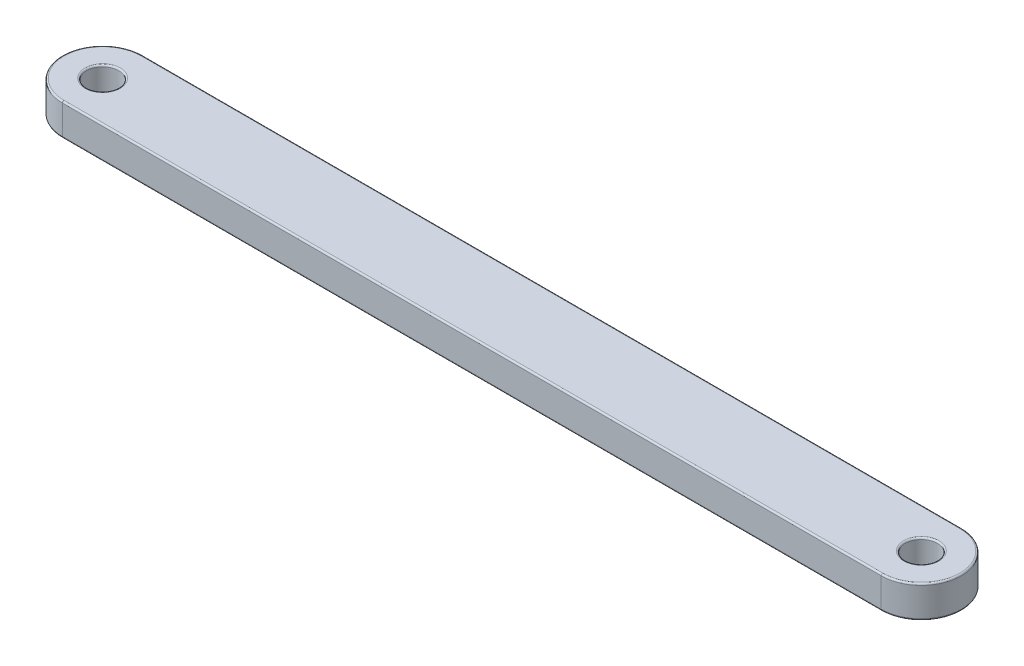
ISO-10303-21;
HEADER;
FILE_DESCRIPTION(('STEP AP214'),'2;1');
FILE_NAME('part.step','',(''),(''),'','','');
FILE_SCHEMA(('AUTOMOTIVE_DESIGN { 1 0 10303 214 1 1 1 1 }'));
ENDSEC;
DATA;
#1=APPLICATION_CONTEXT('core data for automotive mechanical design processes');
#2=APPLICATION_PROTOCOL_DEFINITION('international standard','automotive_design',2000,#1);
#3=PRODUCT_CONTEXT('',#1,'mechanical');
#4=PRODUCT('Part','Part','',(#3));
#5=PRODUCT_RELATED_PRODUCT_CATEGORY('part','',(#4));
#6=PRODUCT_DEFINITION_FORMATION('','',#4);
#7=PRODUCT_DEFINITION_CONTEXT('part definition',#1,'design');
#8=PRODUCT_DEFINITION('design','',#6,#7);
#9=PRODUCT_DEFINITION_SHAPE('','',#8);
#10=(LENGTH_UNIT() NAMED_UNIT(*) SI_UNIT(.MILLI.,.METRE.));
#11=(NAMED_UNIT(*) PLANE_ANGLE_UNIT() SI_UNIT($,.RADIAN.));
#12=(NAMED_UNIT(*) SI_UNIT($,.STERADIAN.) SOLID_ANGLE_UNIT());
#13=UNCERTAINTY_MEASURE_WITH_UNIT(LENGTH_MEASURE(1.E-05),#10,'distance_accuracy_value','');
#14=(GEOMETRIC_REPRESENTATION_CONTEXT(3) GLOBAL_UNCERTAINTY_ASSIGNED_CONTEXT((#13)) GLOBAL_UNIT_ASSIGNED_CONTEXT((#10,
#11,#12)) REPRESENTATION_CONTEXT('',''));
#15=CARTESIAN_POINT('',(0.,0.,0.));
#16=DIRECTION('',(0.,0.,1.));
#17=DIRECTION('',(1.,0.,0.));
#18=AXIS2_PLACEMENT_3D('',#15,#16,#17);
#19=CARTESIAN_POINT('',(-255.,20.,0.));
#20=DIRECTION('',(0.,1.,0.));
#21=DIRECTION('',(0.,0.,1.));
#22=AXIS2_PLACEMENT_3D('',#19,#20,#21);
#23=PLANE('',#22);
#24=CARTESIAN_POINT('',(255.,20.,0.));
#25=DIRECTION('',(0.,1.,0.));
#26=DIRECTION('',(0.,0.,1.));
#27=AXIS2_PLACEMENT_3D('',#24,#25,#26);
#28=CIRCLE('',#27,11.);
#29=CARTESIAN_POINT('',(255.,20.,11.));
#30=VERTEX_POINT('',#29);
#31=EDGE_CURVE('E11',#30,#30,#28,.F.);
#32=ORIENTED_EDGE('',*,*,#31,.T.);
#33=EDGE_LOOP('',(#32));
#34=FACE_BOUND('',#33,.T.);
#35=CARTESIAN_POINT('',(255.,20.,0.));
#36=DIRECTION('',(0.,1.,0.));
#37=DIRECTION('',(0.,0.,1.));
#38=AXIS2_PLACEMENT_3D('',#35,#36,#37);
#39=CIRCLE('',#38,24.);
#40=CARTESIAN_POINT('',(255.,20.,23.9999999999999));
#41=VERTEX_POINT('',#40);
#42=CARTESIAN_POINT('',(255.,20.,-24.0000000000001));
#43=VERTEX_POINT('',#42);
#44=EDGE_CURVE('E50',#41,#43,#39,.T.);
#45=ORIENTED_EDGE('',*,*,#44,.T.);
#46=DIRECTION('',(-1.,0.,0.));
#47=VECTOR('',#46,1.);
#48=CARTESIAN_POINT('',(-255.,20.,-24.));
#49=LINE('',#48,#47);
#50=CARTESIAN_POINT('',(-255.,20.,-24.));
#51=VERTEX_POINT('',#50);
#52=EDGE_CURVE('E42',#43,#51,#49,.T.);
#53=ORIENTED_EDGE('',*,*,#52,.T.);
#54=CARTESIAN_POINT('',(-255.,20.,0.));
#55=DIRECTION('',(0.,1.,0.));
#56=DIRECTION('',(0.,0.,1.));
#57=AXIS2_PLACEMENT_3D('',#54,#55,#56);
#58=CIRCLE('',#57,24.);
#59=CARTESIAN_POINT('',(-255.,20.,24.));
#60=VERTEX_POINT('',#59);
#61=EDGE_CURVE('E168',#51,#60,#58,.T.);
#62=ORIENTED_EDGE('',*,*,#61,.T.);
#63=DIRECTION('',(1.,0.,0.));
#64=VECTOR('',#63,1.);
#65=CARTESIAN_POINT('',(255.,20.,23.9999999999999));
#66=LINE('',#65,#64);
#67=EDGE_CURVE('E55',#60,#41,#66,.T.);
#68=ORIENTED_EDGE('',*,*,#67,.T.);
#69=EDGE_LOOP('',(#45,#53,#62,#68));
#70=FACE_BOUND('',#69,.T.);
#71=CARTESIAN_POINT('',(-255.,20.,0.));
#72=DIRECTION('',(0.,1.,0.));
#73=DIRECTION('',(0.,0.,1.));
#74=AXIS2_PLACEMENT_3D('',#71,#72,#73);
#75=CIRCLE('',#74,11.);
#76=CARTESIAN_POINT('',(-255.,20.,11.));
#77=VERTEX_POINT('',#76);
#78=EDGE_CURVE('E165',#77,#77,#75,.F.);
#79=ORIENTED_EDGE('',*,*,#78,.T.);
#80=EDGE_LOOP('',(#79));
#81=FACE_BOUND('',#80,.T.);
#82=ADVANCED_FACE('F33',(#34,#70,#81),#23,.T.);
#83=CARTESIAN_POINT('',(-255.,0.,0.));
#84=DIRECTION('',(0.,1.,0.));
#85=DIRECTION('',(0.,0.,1.));
#86=AXIS2_PLACEMENT_3D('',#83,#84,#85);
#87=PLANE('',#86);
#88=CARTESIAN_POINT('',(255.,0.,0.));
#89=DIRECTION('',(0.,1.,0.));
#90=DIRECTION('',(0.,0.,1.));
#91=AXIS2_PLACEMENT_3D('',#88,#89,#90);
#92=CIRCLE('',#91,11.);
#93=CARTESIAN_POINT('',(255.,0.,11.));
#94=VERTEX_POINT('',#93);
#95=EDGE_CURVE('E130',#94,#94,#92,.T.);
#96=ORIENTED_EDGE('',*,*,#95,.T.);
#97=EDGE_LOOP('',(#96));
#98=FACE_BOUND('',#97,.T.);
#99=CARTESIAN_POINT('',(-255.,0.,0.));
#100=DIRECTION('',(0.,1.,0.));
#101=DIRECTION('',(0.,0.,1.));
#102=AXIS2_PLACEMENT_3D('',#99,#100,#101);
#103=CIRCLE('',#102,11.);
#104=CARTESIAN_POINT('',(-255.,0.,11.));
#105=VERTEX_POINT('',#104);
#106=EDGE_CURVE('E127',#105,#105,#103,.T.);
#107=ORIENTED_EDGE('',*,*,#106,.T.);
#108=EDGE_LOOP('',(#107));
#109=FACE_BOUND('',#108,.T.);
#110=CARTESIAN_POINT('',(255.,0.,0.));
#111=DIRECTION('',(0.,1.,0.));
#112=DIRECTION('',(0.,0.,1.));
#113=AXIS2_PLACEMENT_3D('',#110,#111,#112);
#114=CIRCLE('',#113,24.);
#115=CARTESIAN_POINT('',(255.,0.,-24.0000000000001));
#116=VERTEX_POINT('',#115);
#117=CARTESIAN_POINT('',(255.,0.,23.9999999999999));
#118=VERTEX_POINT('',#117);
#119=EDGE_CURVE('E126',#116,#118,#114,.F.);
#120=ORIENTED_EDGE('',*,*,#119,.T.);
#121=DIRECTION('',(1.,0.,0.));
#122=VECTOR('',#121,1.);
#123=CARTESIAN_POINT('',(-255.,0.,24.));
#124=LINE('',#123,#122);
#125=CARTESIAN_POINT('',(-255.,0.,24.));
#126=VERTEX_POINT('',#125);
#127=EDGE_CURVE('E105',#118,#126,#124,.F.);
#128=ORIENTED_EDGE('',*,*,#127,.T.);
#129=CARTESIAN_POINT('',(-255.,0.,0.));
#130=DIRECTION('',(0.,1.,0.));
#131=DIRECTION('',(0.,0.,1.));
#132=AXIS2_PLACEMENT_3D('',#129,#130,#131);
#133=CIRCLE('',#132,24.);
#134=CARTESIAN_POINT('',(-255.,0.,-24.));
#135=VERTEX_POINT('',#134);
#136=EDGE_CURVE('E115',#126,#135,#133,.F.);
#137=ORIENTED_EDGE('',*,*,#136,.T.);
#138=DIRECTION('',(-1.,0.,0.));
#139=VECTOR('',#138,1.);
#140=CARTESIAN_POINT('',(-255.,0.,-24.));
#141=LINE('',#140,#139);
#142=EDGE_CURVE('E121',#135,#116,#141,.F.);
#143=ORIENTED_EDGE('',*,*,#142,.T.);
#144=EDGE_LOOP('',(#120,#128,#137,#143));
#145=FACE_BOUND('',#144,.T.);
#146=ADVANCED_FACE('F124',(#98,#109,#145),#87,.F.);
#147=CARTESIAN_POINT('',(-255.,20.,0.));
#148=DIRECTION('',(0.,-1.,0.));
#149=DIRECTION('',(0.,0.,-1.));
#150=AXIS2_PLACEMENT_3D('',#147,#148,#149);
#151=CYLINDRICAL_SURFACE('',#150,25.);
#152=DIRECTION('',(0.,-1.,0.));
#153=VECTOR('',#152,1.);
#154=CARTESIAN_POINT('',(-255.,20.,-25.));
#155=LINE('',#154,#153);
#156=CARTESIAN_POINT('',(-255.,19.,-25.));
#157=VERTEX_POINT('',#156);
#158=CARTESIAN_POINT('',(-255.,1.,-25.));
#159=VERTEX_POINT('',#158);
#160=EDGE_CURVE('E177',#157,#159,#155,.T.);
#161=ORIENTED_EDGE('',*,*,#160,.T.);
#162=CARTESIAN_POINT('',(-255.,1.,0.));
#163=DIRECTION('',(0.,1.,0.));
#164=DIRECTION('',(0.,0.,1.));
#165=AXIS2_PLACEMENT_3D('',#162,#163,#164);
#166=CIRCLE('',#165,25.);
#167=CARTESIAN_POINT('',(-255.,1.,25.));
#168=VERTEX_POINT('',#167);
#169=EDGE_CURVE('E163',#159,#168,#166,.T.);
#170=ORIENTED_EDGE('',*,*,#169,.T.);
#171=DIRECTION('',(0.,-1.,0.));
#172=VECTOR('',#171,1.);
#173=CARTESIAN_POINT('',(-255.,20.,25.));
#174=LINE('',#173,#172);
#175=CARTESIAN_POINT('',(-255.,19.,25.));
#176=VERTEX_POINT('',#175);
#177=EDGE_CURVE('E122',#176,#168,#174,.T.);
#178=ORIENTED_EDGE('',*,*,#177,.F.);
#179=CARTESIAN_POINT('',(-255.,19.,0.));
#180=DIRECTION('',(0.,1.,0.));
#181=DIRECTION('',(0.,0.,1.));
#182=AXIS2_PLACEMENT_3D('',#179,#180,#181);
#183=CIRCLE('',#182,25.);
#184=EDGE_CURVE('E161',#176,#157,#183,.F.);
#185=ORIENTED_EDGE('',*,*,#184,.T.);
#186=EDGE_LOOP('',(#161,#170,#178,#185));
#187=FACE_BOUND('',#186,.T.);
#188=ADVANCED_FACE('F203',(#187),#151,.T.);
#189=CARTESIAN_POINT('',(-255.,20.,25.));
#190=DIRECTION('',(0.,0.,-1.));
#191=DIRECTION('',(-1.,0.,0.));
#192=AXIS2_PLACEMENT_3D('',#189,#190,#191);
#193=PLANE('',#192);
#194=ORIENTED_EDGE('',*,*,#177,.T.);
#195=DIRECTION('',(1.,0.,0.));
#196=VECTOR('',#195,1.);
#197=CARTESIAN_POINT('',(-255.,1.,25.));
#198=LINE('',#197,#196);
#199=CARTESIAN_POINT('',(255.,1.,24.9999999999999));
#200=VERTEX_POINT('',#199);
#201=EDGE_CURVE('E108',#168,#200,#198,.T.);
#202=ORIENTED_EDGE('',*,*,#201,.T.);
#203=DIRECTION('',(0.,-1.,0.));
#204=VECTOR('',#203,1.);
#205=CARTESIAN_POINT('',(255.,20.,24.9999999999999));
#206=LINE('',#205,#204);
#207=CARTESIAN_POINT('',(255.,19.,24.9999999999999));
#208=VERTEX_POINT('',#207);
#209=EDGE_CURVE('E200',#208,#200,#206,.T.);
#210=ORIENTED_EDGE('',*,*,#209,.F.);
#211=DIRECTION('',(1.,0.,0.));
#212=VECTOR('',#211,1.);
#213=CARTESIAN_POINT('',(-255.,19.,25.));
#214=LINE('',#213,#212);
#215=EDGE_CURVE('E149',#208,#176,#214,.F.);
#216=ORIENTED_EDGE('',*,*,#215,.T.);
#217=EDGE_LOOP('',(#194,#202,#210,#216));
#218=FACE_BOUND('',#217,.T.);
#219=ADVANCED_FACE('F198',(#218),#193,.F.);
#220=CARTESIAN_POINT('',(255.,20.,0.));
#221=DIRECTION('',(0.,-1.,0.));
#222=DIRECTION('',(0.,0.,-1.));
#223=AXIS2_PLACEMENT_3D('',#220,#221,#222);
#224=CYLINDRICAL_SURFACE('',#223,25.);
#225=ORIENTED_EDGE('',*,*,#209,.T.);
#226=CARTESIAN_POINT('',(255.,1.,0.));
#227=DIRECTION('',(0.,1.,0.));
#228=DIRECTION('',(0.,0.,1.));
#229=AXIS2_PLACEMENT_3D('',#226,#227,#228);
#230=CIRCLE('',#229,25.);
#231=CARTESIAN_POINT('',(255.,1.,-25.0000000000001));
#232=VERTEX_POINT('',#231);
#233=EDGE_CURVE('E154',#200,#232,#230,.T.);
#234=ORIENTED_EDGE('',*,*,#233,.T.);
#235=DIRECTION('',(0.,-1.,0.));
#236=VECTOR('',#235,1.);
#237=CARTESIAN_POINT('',(255.,20.,-25.0000000000001));
#238=LINE('',#237,#236);
#239=CARTESIAN_POINT('',(255.,19.,-25.0000000000001));
#240=VERTEX_POINT('',#239);
#241=EDGE_CURVE('E206',#240,#232,#238,.T.);
#242=ORIENTED_EDGE('',*,*,#241,.F.);
#243=CARTESIAN_POINT('',(255.,19.,0.));
#244=DIRECTION('',(0.,1.,0.));
#245=DIRECTION('',(0.,0.,1.));
#246=AXIS2_PLACEMENT_3D('',#243,#244,#245);
#247=CIRCLE('',#246,25.);
#248=EDGE_CURVE('E152',#240,#208,#247,.F.);
#249=ORIENTED_EDGE('',*,*,#248,.T.);
#250=EDGE_LOOP('',(#225,#234,#242,#249));
#251=FACE_BOUND('',#250,.T.);
#252=ADVANCED_FACE('F219',(#251),#224,.T.);
#253=CARTESIAN_POINT('',(-255.,20.,-25.));
#254=DIRECTION('',(0.,0.,1.));
#255=DIRECTION('',(1.,0.,0.));
#256=AXIS2_PLACEMENT_3D('',#253,#254,#255);
#257=PLANE('',#256);
#258=ORIENTED_EDGE('',*,*,#241,.T.);
#259=DIRECTION('',(-1.,0.,0.));
#260=VECTOR('',#259,1.);
#261=CARTESIAN_POINT('',(-255.,1.,-25.));
#262=LINE('',#261,#260);
#263=EDGE_CURVE('E159',#232,#159,#262,.T.);
#264=ORIENTED_EDGE('',*,*,#263,.T.);
#265=ORIENTED_EDGE('',*,*,#160,.F.);
#266=DIRECTION('',(-1.,0.,0.));
#267=VECTOR('',#266,1.);
#268=CARTESIAN_POINT('',(255.,19.,-25.0000000000001));
#269=LINE('',#268,#267);
#270=EDGE_CURVE('E156',#157,#240,#269,.F.);
#271=ORIENTED_EDGE('',*,*,#270,.T.);
#272=EDGE_LOOP('',(#258,#264,#265,#271));
#273=FACE_BOUND('',#272,.T.);
#274=ADVANCED_FACE('F223',(#273),#257,.F.);
#275=CARTESIAN_POINT('',(-255.,20.,0.));
#276=DIRECTION('',(0.,-1.,0.));
#277=DIRECTION('',(0.,0.,-1.));
#278=AXIS2_PLACEMENT_3D('',#275,#276,#277);
#279=CYLINDRICAL_SURFACE('',#278,10.);
#280=CARTESIAN_POINT('',(-255.,1.,0.));
#281=DIRECTION('',(0.,1.,0.));
#282=DIRECTION('',(0.,0.,1.));
#283=AXIS2_PLACEMENT_3D('',#280,#281,#282);
#284=CIRCLE('',#283,10.);
#285=CARTESIAN_POINT('',(-255.,1.,10.));
#286=VERTEX_POINT('',#285);
#287=EDGE_CURVE('E146',#286,#286,#284,.F.);
#288=ORIENTED_EDGE('',*,*,#287,.T.);
#289=EDGE_LOOP('',(#288));
#290=FACE_BOUND('',#289,.T.);
#291=CARTESIAN_POINT('',(-255.,19.,0.));
#292=DIRECTION('',(0.,1.,0.));
#293=DIRECTION('',(0.,0.,1.));
#294=AXIS2_PLACEMENT_3D('',#291,#292,#293);
#295=CIRCLE('',#294,10.);
#296=CARTESIAN_POINT('',(-255.,19.,10.));
#297=VERTEX_POINT('',#296);
#298=EDGE_CURVE('E143',#297,#297,#295,.T.);
#299=ORIENTED_EDGE('',*,*,#298,.T.);
#300=EDGE_LOOP('',(#299));
#301=FACE_BOUND('',#300,.T.);
#302=ADVANCED_FACE('F239',(#290,#301),#279,.F.);
#303=CARTESIAN_POINT('',(255.,20.,0.));
#304=DIRECTION('',(0.,-1.,0.));
#305=DIRECTION('',(0.,0.,-1.));
#306=AXIS2_PLACEMENT_3D('',#303,#304,#305);
#307=CYLINDRICAL_SURFACE('',#306,9.99999999999998);
#308=CARTESIAN_POINT('',(255.,1.,0.));
#309=DIRECTION('',(0.,1.,0.));
#310=DIRECTION('',(0.,0.,1.));
#311=AXIS2_PLACEMENT_3D('',#308,#309,#310);
#312=CIRCLE('',#311,9.99999999999998);
#313=CARTESIAN_POINT('',(255.,1.,9.99999999999998));
#314=VERTEX_POINT('',#313);
#315=EDGE_CURVE('E140',#314,#314,#312,.F.);
#316=ORIENTED_EDGE('',*,*,#315,.T.);
#317=EDGE_LOOP('',(#316));
#318=FACE_BOUND('',#317,.T.);
#319=CARTESIAN_POINT('',(255.,19.,0.));
#320=DIRECTION('',(0.,1.,0.));
#321=DIRECTION('',(0.,0.,1.));
#322=AXIS2_PLACEMENT_3D('',#319,#320,#321);
#323=CIRCLE('',#322,9.99999999999998);
#324=CARTESIAN_POINT('',(255.,19.,9.99999999999998));
#325=VERTEX_POINT('',#324);
#326=EDGE_CURVE('E137',#325,#325,#323,.T.);
#327=ORIENTED_EDGE('',*,*,#326,.T.);
#328=EDGE_LOOP('',(#327));
#329=FACE_BOUND('',#328,.T.);
#330=ADVANCED_FACE('F241',(#318,#329),#307,.F.);
#331=CARTESIAN_POINT('',(255.,1.,0.));
#332=DIRECTION('',(0.,1.,0.));
#333=DIRECTION('',(0.,0.,1.));
#334=AXIS2_PLACEMENT_3D('',#331,#332,#333);
#335=TOROIDAL_SURFACE('',#334,11.,1.);
#336=ORIENTED_EDGE('',*,*,#315,.F.);
#337=EDGE_LOOP('',(#336));
#338=FACE_BOUND('',#337,.T.);
#339=ORIENTED_EDGE('',*,*,#95,.F.);
#340=EDGE_LOOP('',(#339));
#341=FACE_BOUND('',#340,.T.);
#342=ADVANCED_FACE('F248',(#338,#341),#335,.T.);
#343=CARTESIAN_POINT('',(-255.,1.,0.));
#344=DIRECTION('',(0.,1.,0.));
#345=DIRECTION('',(0.,0.,1.));
#346=AXIS2_PLACEMENT_3D('',#343,#344,#345);
#347=TOROIDAL_SURFACE('',#346,11.,1.);
#348=ORIENTED_EDGE('',*,*,#287,.F.);
#349=EDGE_LOOP('',(#348));
#350=FACE_BOUND('',#349,.T.);
#351=ORIENTED_EDGE('',*,*,#106,.F.);
#352=EDGE_LOOP('',(#351));
#353=FACE_BOUND('',#352,.T.);
#354=ADVANCED_FACE('F264',(#350,#353),#347,.T.);
#355=CARTESIAN_POINT('',(-255.,1.,-24.));
#356=DIRECTION('',(-1.,0.,0.));
#357=DIRECTION('',(0.,0.,1.));
#358=AXIS2_PLACEMENT_3D('',#355,#356,#357);
#359=CYLINDRICAL_SURFACE('',#358,1.);
#360=CARTESIAN_POINT('',(255.,1.,-24.0000000000001));
#361=DIRECTION('',(1.,0.,0.));
#362=DIRECTION('',(0.,0.,-1.));
#363=AXIS2_PLACEMENT_3D('',#360,#361,#362);
#364=CIRCLE('',#363,1.);
#365=EDGE_CURVE('E111',#116,#232,#364,.T.);
#366=ORIENTED_EDGE('',*,*,#365,.F.);
#367=ORIENTED_EDGE('',*,*,#142,.F.);
#368=CARTESIAN_POINT('',(-255.,1.,-24.));
#369=DIRECTION('',(-1.,0.,0.));
#370=DIRECTION('',(0.,0.,1.));
#371=AXIS2_PLACEMENT_3D('',#368,#369,#370);
#372=CIRCLE('',#371,1.);
#373=EDGE_CURVE('E118',#159,#135,#372,.T.);
#374=ORIENTED_EDGE('',*,*,#373,.F.);
#375=ORIENTED_EDGE('',*,*,#263,.F.);
#376=EDGE_LOOP('',(#366,#367,#374,#375));
#377=FACE_BOUND('',#376,.T.);
#378=ADVANCED_FACE('F212',(#377),#359,.T.);
#379=CARTESIAN_POINT('',(-255.,1.,0.));
#380=DIRECTION('',(0.,1.,0.));
#381=DIRECTION('',(0.,0.,1.));
#382=AXIS2_PLACEMENT_3D('',#379,#380,#381);
#383=TOROIDAL_SURFACE('',#382,24.,1.);
#384=ORIENTED_EDGE('',*,*,#373,.T.);
#385=ORIENTED_EDGE('',*,*,#136,.F.);
#386=CARTESIAN_POINT('',(-255.,1.,24.));
#387=DIRECTION('',(1.,0.,0.));
#388=DIRECTION('',(0.,0.,-1.));
#389=AXIS2_PLACEMENT_3D('',#386,#387,#388);
#390=CIRCLE('',#389,1.);
#391=EDGE_CURVE('E101',#168,#126,#390,.T.);
#392=ORIENTED_EDGE('',*,*,#391,.F.);
#393=ORIENTED_EDGE('',*,*,#169,.F.);
#394=EDGE_LOOP('',(#384,#385,#392,#393));
#395=FACE_BOUND('',#394,.T.);
#396=ADVANCED_FACE('F116',(#395),#383,.T.);
#397=CARTESIAN_POINT('',(255.,1.,0.));
#398=DIRECTION('',(0.,1.,0.));
#399=DIRECTION('',(0.,0.,1.));
#400=AXIS2_PLACEMENT_3D('',#397,#398,#399);
#401=TOROIDAL_SURFACE('',#400,24.,1.);
#402=ORIENTED_EDGE('',*,*,#365,.T.);
#403=ORIENTED_EDGE('',*,*,#233,.F.);
#404=CARTESIAN_POINT('',(255.,1.,23.9999999999999));
#405=DIRECTION('',(-1.,0.,0.));
#406=DIRECTION('',(0.,0.,1.));
#407=AXIS2_PLACEMENT_3D('',#404,#405,#406);
#408=CIRCLE('',#407,1.);
#409=EDGE_CURVE('E112',#118,#200,#408,.T.);
#410=ORIENTED_EDGE('',*,*,#409,.F.);
#411=ORIENTED_EDGE('',*,*,#119,.F.);
#412=EDGE_LOOP('',(#402,#403,#410,#411));
#413=FACE_BOUND('',#412,.T.);
#414=ADVANCED_FACE('F215',(#413),#401,.T.);
#415=CARTESIAN_POINT('',(-255.,1.,24.));
#416=DIRECTION('',(1.,0.,0.));
#417=DIRECTION('',(0.,0.,-1.));
#418=AXIS2_PLACEMENT_3D('',#415,#416,#417);
#419=CYLINDRICAL_SURFACE('',#418,1.);
#420=ORIENTED_EDGE('',*,*,#391,.T.);
#421=ORIENTED_EDGE('',*,*,#127,.F.);
#422=ORIENTED_EDGE('',*,*,#409,.T.);
#423=ORIENTED_EDGE('',*,*,#201,.F.);
#424=EDGE_LOOP('',(#420,#421,#422,#423));
#425=FACE_BOUND('',#424,.T.);
#426=ADVANCED_FACE('F103',(#425),#419,.T.);
#427=CARTESIAN_POINT('',(255.,19.,0.));
#428=DIRECTION('',(0.,1.,0.));
#429=DIRECTION('',(0.,0.,1.));
#430=AXIS2_PLACEMENT_3D('',#427,#428,#429);
#431=TOROIDAL_SURFACE('',#430,11.,1.);
#432=ORIENTED_EDGE('',*,*,#31,.F.);
#433=EDGE_LOOP('',(#432));
#434=FACE_BOUND('',#433,.T.);
#435=ORIENTED_EDGE('',*,*,#326,.F.);
#436=EDGE_LOOP('',(#435));
#437=FACE_BOUND('',#436,.T.);
#438=ADVANCED_FACE('F271',(#434,#437),#431,.T.);
#439=CARTESIAN_POINT('',(-255.,19.,24.));
#440=DIRECTION('',(-1.,0.,0.));
#441=DIRECTION('',(0.,0.,1.));
#442=AXIS2_PLACEMENT_3D('',#439,#440,#441);
#443=CYLINDRICAL_SURFACE('',#442,1.);
#444=CARTESIAN_POINT('',(-255.,19.,24.));
#445=DIRECTION('',(-1.,0.,0.));
#446=DIRECTION('',(0.,0.,1.));
#447=AXIS2_PLACEMENT_3D('',#444,#445,#446);
#448=CIRCLE('',#447,1.);
#449=EDGE_CURVE('E181',#176,#60,#448,.T.);
#450=ORIENTED_EDGE('',*,*,#449,.F.);
#451=ORIENTED_EDGE('',*,*,#215,.F.);
#452=CARTESIAN_POINT('',(255.,19.,23.9999999999999));
#453=DIRECTION('',(1.,0.,0.));
#454=DIRECTION('',(0.,0.,-1.));
#455=AXIS2_PLACEMENT_3D('',#452,#453,#454);
#456=CIRCLE('',#455,1.);
#457=EDGE_CURVE('E37',#41,#208,#456,.T.);
#458=ORIENTED_EDGE('',*,*,#457,.F.);
#459=ORIENTED_EDGE('',*,*,#67,.F.);
#460=EDGE_LOOP('',(#450,#451,#458,#459));
#461=FACE_BOUND('',#460,.T.);
#462=ADVANCED_FACE('F193',(#461),#443,.T.);
#463=CARTESIAN_POINT('',(255.,19.,0.));
#464=DIRECTION('',(0.,1.,0.));
#465=DIRECTION('',(0.,0.,1.));
#466=AXIS2_PLACEMENT_3D('',#463,#464,#465);
#467=TOROIDAL_SURFACE('',#466,24.,1.);
#468=ORIENTED_EDGE('',*,*,#457,.T.);
#469=ORIENTED_EDGE('',*,*,#248,.F.);
#470=CARTESIAN_POINT('',(255.,19.,-24.0000000000001));
#471=DIRECTION('',(-1.,0.,0.));
#472=DIRECTION('',(0.,0.,1.));
#473=AXIS2_PLACEMENT_3D('',#470,#471,#472);
#474=CIRCLE('',#473,1.);
#475=EDGE_CURVE('E180',#43,#240,#474,.T.);
#476=ORIENTED_EDGE('',*,*,#475,.F.);
#477=ORIENTED_EDGE('',*,*,#44,.F.);
#478=EDGE_LOOP('',(#468,#469,#476,#477));
#479=FACE_BOUND('',#478,.T.);
#480=ADVANCED_FACE('F190',(#479),#467,.T.);
#481=CARTESIAN_POINT('',(-255.,19.,0.));
#482=DIRECTION('',(0.,1.,0.));
#483=DIRECTION('',(0.,0.,1.));
#484=AXIS2_PLACEMENT_3D('',#481,#482,#483);
#485=TOROIDAL_SURFACE('',#484,24.,1.);
#486=ORIENTED_EDGE('',*,*,#449,.T.);
#487=ORIENTED_EDGE('',*,*,#61,.F.);
#488=CARTESIAN_POINT('',(-255.,19.,-24.));
#489=DIRECTION('',(1.,0.,0.));
#490=DIRECTION('',(0.,0.,-1.));
#491=AXIS2_PLACEMENT_3D('',#488,#489,#490);
#492=CIRCLE('',#491,1.);
#493=EDGE_CURVE('E178',#157,#51,#492,.T.);
#494=ORIENTED_EDGE('',*,*,#493,.F.);
#495=ORIENTED_EDGE('',*,*,#184,.F.);
#496=EDGE_LOOP('',(#486,#487,#494,#495));
#497=FACE_BOUND('',#496,.T.);
#498=ADVANCED_FACE('F228',(#497),#485,.T.);
#499=CARTESIAN_POINT('',(-255.,19.,-24.));
#500=DIRECTION('',(1.,0.,0.));
#501=DIRECTION('',(0.,0.,-1.));
#502=AXIS2_PLACEMENT_3D('',#499,#500,#501);
#503=CYLINDRICAL_SURFACE('',#502,1.);
#504=ORIENTED_EDGE('',*,*,#475,.T.);
#505=ORIENTED_EDGE('',*,*,#270,.F.);
#506=ORIENTED_EDGE('',*,*,#493,.T.);
#507=ORIENTED_EDGE('',*,*,#52,.F.);
#508=EDGE_LOOP('',(#504,#505,#506,#507));
#509=FACE_BOUND('',#508,.T.);
#510=ADVANCED_FACE('F226',(#509),#503,.T.);
#511=CARTESIAN_POINT('',(-255.,19.,0.));
#512=DIRECTION('',(0.,1.,0.));
#513=DIRECTION('',(0.,0.,1.));
#514=AXIS2_PLACEMENT_3D('',#511,#512,#513);
#515=TOROIDAL_SURFACE('',#514,11.,1.);
#516=ORIENTED_EDGE('',*,*,#78,.F.);
#517=EDGE_LOOP('',(#516));
#518=FACE_BOUND('',#517,.T.);
#519=ORIENTED_EDGE('',*,*,#298,.F.);
#520=EDGE_LOOP('',(#519));
#521=FACE_BOUND('',#520,.T.);
#522=ADVANCED_FACE('F35',(#518,#521),#515,.T.);
#523=CLOSED_SHELL('',(#82,#146,#188,#219,#252,#274,#302,#330,#342,#354,#378,#396,#414,#426,#438,
#462,#480,#498,#510,#522));
#524=MANIFOLD_SOLID_BREP('B2',#523);
#525=ADVANCED_BREP_SHAPE_REPRESENTATION('',(#18,#524),#14);
#526=SHAPE_DEFINITION_REPRESENTATION(#9,#525);
ENDSEC;
END-ISO-10303-21;
